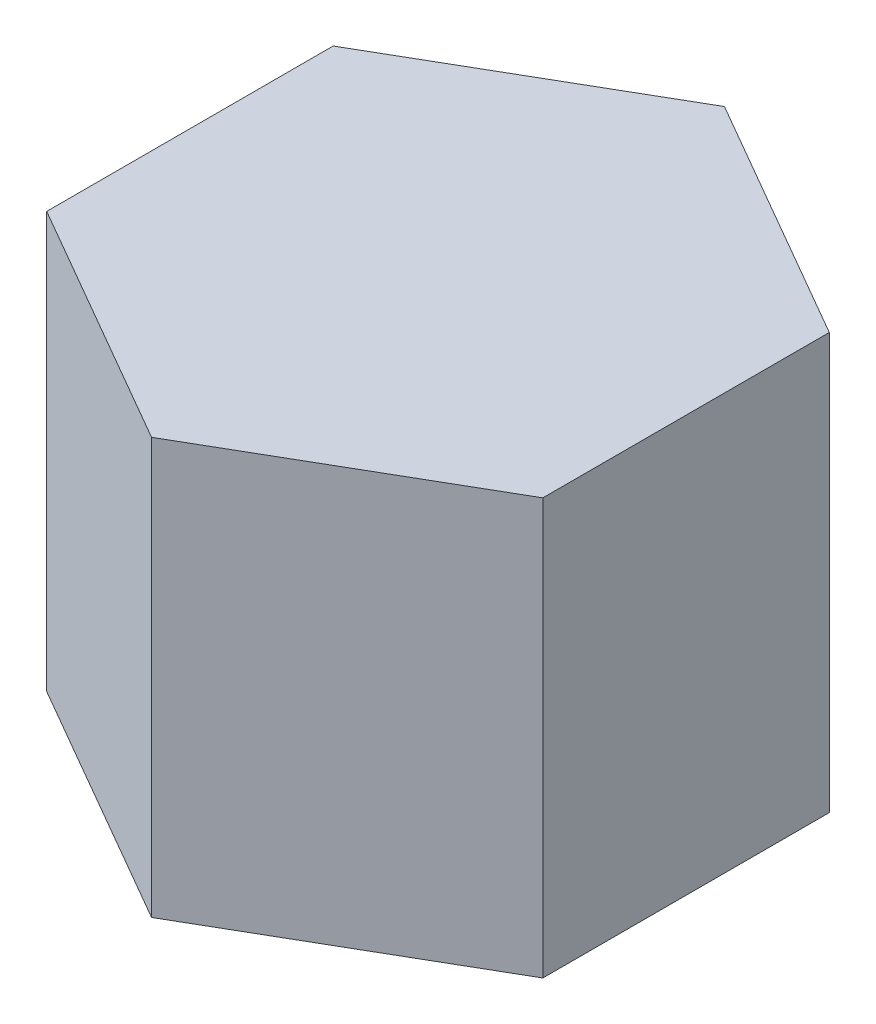
ISO-10303-21;
HEADER;
FILE_DESCRIPTION(('STEP AP214'),'2;1');
FILE_NAME('part.step','',(''),(''),'','','');
FILE_SCHEMA(('AUTOMOTIVE_DESIGN { 1 0 10303 214 1 1 1 1 }'));
ENDSEC;
DATA;
#1=APPLICATION_CONTEXT('core data for automotive mechanical design processes');
#2=APPLICATION_PROTOCOL_DEFINITION('international standard','automotive_design',2000,#1);
#3=PRODUCT_CONTEXT('',#1,'mechanical');
#4=PRODUCT('Part','Part','',(#3));
#5=PRODUCT_RELATED_PRODUCT_CATEGORY('part','',(#4));
#6=PRODUCT_DEFINITION_FORMATION('','',#4);
#7=PRODUCT_DEFINITION_CONTEXT('part definition',#1,'design');
#8=PRODUCT_DEFINITION('design','',#6,#7);
#9=PRODUCT_DEFINITION_SHAPE('','',#8);
#10=(LENGTH_UNIT() NAMED_UNIT(*) SI_UNIT(.MILLI.,.METRE.));
#11=(NAMED_UNIT(*) PLANE_ANGLE_UNIT() SI_UNIT($,.RADIAN.));
#12=(NAMED_UNIT(*) SI_UNIT($,.STERADIAN.) SOLID_ANGLE_UNIT());
#13=UNCERTAINTY_MEASURE_WITH_UNIT(LENGTH_MEASURE(1.E-05),#10,'distance_accuracy_value','');
#14=(GEOMETRIC_REPRESENTATION_CONTEXT(3) GLOBAL_UNCERTAINTY_ASSIGNED_CONTEXT((#13)) GLOBAL_UNIT_ASSIGNED_CONTEXT((#10,
#11,#12)) REPRESENTATION_CONTEXT('',''));
#15=CARTESIAN_POINT('',(0.,0.,0.));
#16=DIRECTION('',(0.,0.,1.));
#17=DIRECTION('',(1.,0.,0.));
#18=AXIS2_PLACEMENT_3D('',#15,#16,#17);
#19=CARTESIAN_POINT('',(208.642660308706,-148.537700895744,293.239022028063));
#20=DIRECTION('',(-0.499999999999909,0.,-0.866025403784491));
#21=DIRECTION('',(-0.866025403784491,0.,0.499999999999909));
#22=AXIS2_PLACEMENT_3D('',#19,#20,#21);
#23=PLANE('',#22);
#24=CARTESIAN_POINT('',(208.339551417382,-149.045793579175,293.414022028063));
#25=DIRECTION('',(0.866025403784491,0.,-0.499999999999909));
#26=VECTOR('',#25,1.);
#27=LINE('',#24,#26);
#28=CARTESIAN_POINT('',(208.339551417382,-149.045793579175,293.414022028063));
#29=VERTEX_POINT('',#28);
#30=CARTESIAN_POINT('',(208.642660308706,-149.045793579175,293.239022028063));
#31=VERTEX_POINT('',#30);
#32=EDGE_CURVE('E170',#29,#31,#27,.T.);
#33=ORIENTED_EDGE('',*,*,#32,.T.);
#34=CARTESIAN_POINT('',(208.642660308706,-148.537700895744,293.239022028063));
#35=DIRECTION('',(0.,-1.,0.));
#36=VECTOR('',#35,1.);
#37=LINE('',#34,#36);
#38=CARTESIAN_POINT('',(208.642660308706,-148.537700895744,293.239022028063));
#39=VERTEX_POINT('',#38);
#40=EDGE_CURVE('E35',#39,#31,#37,.T.);
#41=ORIENTED_EDGE('',*,*,#40,.F.);
#42=CARTESIAN_POINT('',(208.339551417382,-148.537700895744,293.414022028063));
#43=DIRECTION('',(0.866025403784491,0.,-0.499999999999909));
#44=VECTOR('',#43,1.);
#45=LINE('',#42,#44);
#46=CARTESIAN_POINT('',(208.339551417382,-148.537700895744,293.414022028063));
#47=VERTEX_POINT('',#46);
#48=EDGE_CURVE('E159',#47,#39,#45,.T.);
#49=ORIENTED_EDGE('',*,*,#48,.F.);
#50=CARTESIAN_POINT('',(208.339551417382,-148.537700895744,293.414022028063));
#51=DIRECTION('',(0.,-1.,0.));
#52=VECTOR('',#51,1.);
#53=LINE('',#50,#52);
#54=EDGE_CURVE('E10',#47,#29,#53,.T.);
#55=ORIENTED_EDGE('',*,*,#54,.T.);
#56=EDGE_LOOP('',(#33,#41,#49,#55));
#57=FACE_BOUND('',#56,.T.);
#58=ADVANCED_FACE('F16',(#57),#23,.F.);
#59=CARTESIAN_POINT('',(208.339551417382,-148.537700895744,293.414022028063));
#60=DIRECTION('',(0.500000000000062,0.,-0.866025403784403));
#61=DIRECTION('',(-0.866025403784403,0.,-0.500000000000062));
#62=AXIS2_PLACEMENT_3D('',#59,#60,#61);
#63=PLANE('',#62);
#64=CARTESIAN_POINT('',(208.036442526057,-149.045793579175,293.239022028063));
#65=DIRECTION('',(0.866025403784403,0.,0.500000000000062));
#66=VECTOR('',#65,1.);
#67=LINE('',#64,#66);
#68=CARTESIAN_POINT('',(208.036442526057,-149.045793579175,293.239022028063));
#69=VERTEX_POINT('',#68);
#70=EDGE_CURVE('E167',#69,#29,#67,.T.);
#71=ORIENTED_EDGE('',*,*,#70,.T.);
#72=ORIENTED_EDGE('',*,*,#54,.F.);
#73=CARTESIAN_POINT('',(208.036442526057,-148.537700895744,293.239022028063));
#74=DIRECTION('',(0.866025403784403,0.,0.500000000000062));
#75=VECTOR('',#74,1.);
#76=LINE('',#73,#75);
#77=CARTESIAN_POINT('',(208.036442526057,-148.537700895744,293.239022028063));
#78=VERTEX_POINT('',#77);
#79=EDGE_CURVE('E156',#78,#47,#76,.T.);
#80=ORIENTED_EDGE('',*,*,#79,.F.);
#81=CARTESIAN_POINT('',(208.036442526057,-148.537700895744,293.239022028063));
#82=DIRECTION('',(0.,-1.,0.));
#83=VECTOR('',#82,1.);
#84=LINE('',#81,#83);
#85=EDGE_CURVE('E27',#78,#69,#84,.T.);
#86=ORIENTED_EDGE('',*,*,#85,.T.);
#87=EDGE_LOOP('',(#71,#72,#80,#86));
#88=FACE_BOUND('',#87,.T.);
#89=ADVANCED_FACE('F189',(#88),#63,.F.);
#90=CARTESIAN_POINT('',(208.036442526057,-148.537700895744,290.831971220494));
#91=DIRECTION('',(1.,0.,0.));
#92=DIRECTION('',(0.,1.,0.));
#93=AXIS2_PLACEMENT_3D('',#90,#91,#92);
#94=PLANE('',#93);
#95=CARTESIAN_POINT('',(208.036442526057,-149.045793579175,292.889022028063));
#96=DIRECTION('',(0.,0.,1.));
#97=VECTOR('',#96,1.);
#98=LINE('',#95,#97);
#99=CARTESIAN_POINT('',(208.036442526057,-149.045793579175,292.889022028063));
#100=VERTEX_POINT('',#99);
#101=EDGE_CURVE('E163',#100,#69,#98,.T.);
#102=ORIENTED_EDGE('',*,*,#101,.T.);
#103=ORIENTED_EDGE('',*,*,#85,.F.);
#104=CARTESIAN_POINT('',(208.036442526057,-148.537700895744,292.889022028063));
#105=DIRECTION('',(0.,0.,1.));
#106=VECTOR('',#105,1.);
#107=LINE('',#104,#106);
#108=CARTESIAN_POINT('',(208.036442526057,-148.537700895744,292.889022028063));
#109=VERTEX_POINT('',#108);
#110=EDGE_CURVE('E106',#109,#78,#107,.T.);
#111=ORIENTED_EDGE('',*,*,#110,.F.);
#112=CARTESIAN_POINT('',(208.036442526057,-148.537700895744,292.889022028063));
#113=DIRECTION('',(0.,-1.,0.));
#114=VECTOR('',#113,1.);
#115=LINE('',#112,#114);
#116=EDGE_CURVE('E94',#109,#100,#115,.T.);
#117=ORIENTED_EDGE('',*,*,#116,.T.);
#118=EDGE_LOOP('',(#102,#103,#111,#117));
#119=FACE_BOUND('',#118,.T.);
#120=ADVANCED_FACE('F198',(#119),#94,.F.);
#121=CARTESIAN_POINT('',(208.036442526057,-148.537700895744,292.889022028063));
#122=DIRECTION('',(0.499999999999943,0.,0.866025403784472));
#123=DIRECTION('',(0.866025403784472,0.,-0.499999999999943));
#124=AXIS2_PLACEMENT_3D('',#121,#122,#123);
#125=PLANE('',#124);
#126=CARTESIAN_POINT('',(208.339551417382,-149.045793579175,292.714022028063));
#127=DIRECTION('',(-0.866025403784471,0.,0.499999999999943));
#128=VECTOR('',#127,1.);
#129=LINE('',#126,#128);
#130=CARTESIAN_POINT('',(208.339551417382,-149.045793579175,292.714022028063));
#131=VERTEX_POINT('',#130);
#132=EDGE_CURVE('E162',#131,#100,#129,.T.);
#133=ORIENTED_EDGE('',*,*,#132,.T.);
#134=ORIENTED_EDGE('',*,*,#116,.F.);
#135=CARTESIAN_POINT('',(208.339551417382,-148.537700895744,292.714022028063));
#136=DIRECTION('',(-0.866025403784471,0.,0.499999999999943));
#137=VECTOR('',#136,1.);
#138=LINE('',#135,#137);
#139=CARTESIAN_POINT('',(208.339551417382,-148.537700895744,292.714022028063));
#140=VERTEX_POINT('',#139);
#141=EDGE_CURVE('E98',#140,#109,#138,.T.);
#142=ORIENTED_EDGE('',*,*,#141,.F.);
#143=CARTESIAN_POINT('',(208.339551417382,-148.537700895744,292.714022028063));
#144=DIRECTION('',(0.,-1.,0.));
#145=VECTOR('',#144,1.);
#146=LINE('',#143,#145);
#147=EDGE_CURVE('E79',#140,#131,#146,.T.);
#148=ORIENTED_EDGE('',*,*,#147,.T.);
#149=EDGE_LOOP('',(#133,#134,#142,#148));
#150=FACE_BOUND('',#149,.T.);
#151=ADVANCED_FACE('F100',(#150),#125,.F.);
#152=CARTESIAN_POINT('',(208.339551417382,-148.537700895744,292.714022028063));
#153=DIRECTION('',(-0.500000000000062,0.,0.866025403784403));
#154=DIRECTION('',(0.866025403784403,0.,0.500000000000062));
#155=AXIS2_PLACEMENT_3D('',#152,#153,#154);
#156=PLANE('',#155);
#157=CARTESIAN_POINT('',(208.642660308706,-149.045793579175,292.889022028063));
#158=DIRECTION('',(-0.866025403784403,0.,-0.500000000000062));
#159=VECTOR('',#158,1.);
#160=LINE('',#157,#159);
#161=CARTESIAN_POINT('',(208.642660308706,-149.045793579175,292.889022028063));
#162=VERTEX_POINT('',#161);
#163=EDGE_CURVE('E88',#162,#131,#160,.T.);
#164=ORIENTED_EDGE('',*,*,#163,.T.);
#165=ORIENTED_EDGE('',*,*,#147,.F.);
#166=CARTESIAN_POINT('',(208.642660308706,-148.537700895744,292.889022028063));
#167=DIRECTION('',(-0.866025403784403,0.,-0.500000000000062));
#168=VECTOR('',#167,1.);
#169=LINE('',#166,#168);
#170=CARTESIAN_POINT('',(208.642660308706,-148.537700895744,292.889022028063));
#171=VERTEX_POINT('',#170);
#172=EDGE_CURVE('E84',#171,#140,#169,.T.);
#173=ORIENTED_EDGE('',*,*,#172,.F.);
#174=CARTESIAN_POINT('',(208.642660308706,-148.537700895744,292.889022028063));
#175=DIRECTION('',(0.,-1.,0.));
#176=VECTOR('',#175,1.);
#177=LINE('',#174,#176);
#178=EDGE_CURVE('E58',#171,#162,#177,.T.);
#179=ORIENTED_EDGE('',*,*,#178,.T.);
#180=EDGE_LOOP('',(#164,#165,#173,#179));
#181=FACE_BOUND('',#180,.T.);
#182=ADVANCED_FACE('F82',(#181),#156,.F.);
#183=CARTESIAN_POINT('',(208.642660308706,-148.537700895744,290.831971220494));
#184=DIRECTION('',(-1.,0.,0.));
#185=DIRECTION('',(0.,-1.,0.));
#186=AXIS2_PLACEMENT_3D('',#183,#184,#185);
#187=PLANE('',#186);
#188=CARTESIAN_POINT('',(208.642660308706,-149.045793579175,293.239022028063));
#189=DIRECTION('',(0.,0.,-1.));
#190=VECTOR('',#189,1.);
#191=LINE('',#188,#190);
#192=EDGE_CURVE('E160',#31,#162,#191,.T.);
#193=ORIENTED_EDGE('',*,*,#192,.T.);
#194=ORIENTED_EDGE('',*,*,#178,.F.);
#195=CARTESIAN_POINT('',(208.642660308706,-148.537700895744,293.239022028063));
#196=DIRECTION('',(0.,0.,-1.));
#197=VECTOR('',#196,1.);
#198=LINE('',#195,#197);
#199=EDGE_CURVE('E112',#39,#171,#198,.T.);
#200=ORIENTED_EDGE('',*,*,#199,.F.);
#201=ORIENTED_EDGE('',*,*,#40,.T.);
#202=EDGE_LOOP('',(#193,#194,#200,#201));
#203=FACE_BOUND('',#202,.T.);
#204=ADVANCED_FACE('F131',(#203),#187,.F.);
#205=CARTESIAN_POINT('',(206.339551417382,-148.537700895744,290.831971220494));
#206=DIRECTION('',(0.,-1.,0.));
#207=DIRECTION('',(1.,0.,0.));
#208=AXIS2_PLACEMENT_3D('',#205,#206,#207);
#209=PLANE('',#208);
#210=ORIENTED_EDGE('',*,*,#48,.T.);
#211=ORIENTED_EDGE('',*,*,#199,.T.);
#212=ORIENTED_EDGE('',*,*,#172,.T.);
#213=ORIENTED_EDGE('',*,*,#141,.T.);
#214=ORIENTED_EDGE('',*,*,#110,.T.);
#215=ORIENTED_EDGE('',*,*,#79,.T.);
#216=EDGE_LOOP('',(#210,#211,#212,#213,#214,#215));
#217=FACE_BOUND('',#216,.T.);
#218=ADVANCED_FACE('F111',(#217),#209,.F.);
#219=CARTESIAN_POINT('',(206.339551417382,-149.045793579175,290.831971220494));
#220=DIRECTION('',(0.,-1.,0.));
#221=DIRECTION('',(1.,0.,0.));
#222=AXIS2_PLACEMENT_3D('',#219,#220,#221);
#223=PLANE('',#222);
#224=ORIENTED_EDGE('',*,*,#32,.F.);
#225=ORIENTED_EDGE('',*,*,#70,.F.);
#226=ORIENTED_EDGE('',*,*,#101,.F.);
#227=ORIENTED_EDGE('',*,*,#132,.F.);
#228=ORIENTED_EDGE('',*,*,#163,.F.);
#229=ORIENTED_EDGE('',*,*,#192,.F.);
#230=EDGE_LOOP('',(#224,#225,#226,#227,#228,#229));
#231=FACE_BOUND('',#230,.T.);
#232=ADVANCED_FACE('F130',(#231),#223,.T.);
#233=CLOSED_SHELL('',(#58,#89,#120,#151,#182,#204,#218,#232));
#234=MANIFOLD_SOLID_BREP('B1',#233);
#235=ADVANCED_BREP_SHAPE_REPRESENTATION('',(#18,#234),#14);
#236=SHAPE_DEFINITION_REPRESENTATION(#9,#235);
ENDSEC;
END-ISO-10303-21;
